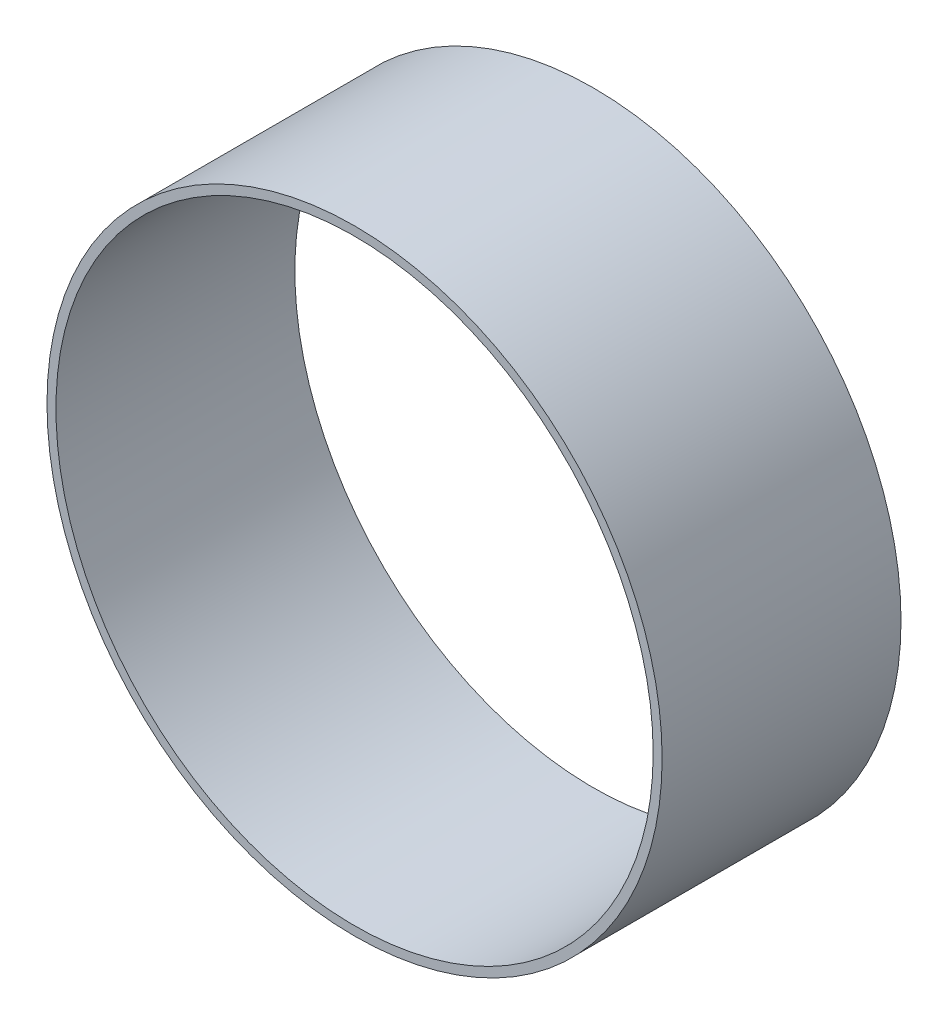
ISO-10303-21;
HEADER;
FILE_DESCRIPTION(('STEP AP214'),'2;1');
FILE_NAME('part.step','',(''),(''),'','','');
FILE_SCHEMA(('AUTOMOTIVE_DESIGN { 1 0 10303 214 1 1 1 1 }'));
ENDSEC;
DATA;
#1=APPLICATION_CONTEXT('core data for automotive mechanical design processes');
#2=APPLICATION_PROTOCOL_DEFINITION('international standard','automotive_design',2000,#1);
#3=PRODUCT_CONTEXT('',#1,'mechanical');
#4=PRODUCT('Part','Part','',(#3));
#5=PRODUCT_RELATED_PRODUCT_CATEGORY('part','',(#4));
#6=PRODUCT_DEFINITION_FORMATION('','',#4);
#7=PRODUCT_DEFINITION_CONTEXT('part definition',#1,'design');
#8=PRODUCT_DEFINITION('design','',#6,#7);
#9=PRODUCT_DEFINITION_SHAPE('','',#8);
#10=(LENGTH_UNIT() NAMED_UNIT(*) SI_UNIT(.MILLI.,.METRE.));
#11=(NAMED_UNIT(*) PLANE_ANGLE_UNIT() SI_UNIT($,.RADIAN.));
#12=(NAMED_UNIT(*) SI_UNIT($,.STERADIAN.) SOLID_ANGLE_UNIT());
#13=UNCERTAINTY_MEASURE_WITH_UNIT(LENGTH_MEASURE(1.E-05),#10,'distance_accuracy_value','');
#14=(GEOMETRIC_REPRESENTATION_CONTEXT(3) GLOBAL_UNCERTAINTY_ASSIGNED_CONTEXT((#13)) GLOBAL_UNIT_ASSIGNED_CONTEXT((#10,
#11,#12)) REPRESENTATION_CONTEXT('',''));
#15=CARTESIAN_POINT('',(0.,0.,0.));
#16=DIRECTION('',(0.,0.,1.));
#17=DIRECTION('',(1.,0.,0.));
#18=AXIS2_PLACEMENT_3D('',#15,#16,#17);
#19=CARTESIAN_POINT('',(0.,0.,25.4));
#20=DIRECTION('',(0.,0.,1.));
#21=DIRECTION('',(1.,0.,0.));
#22=AXIS2_PLACEMENT_3D('',#19,#20,#21);
#23=PLANE('',#22);
#24=CARTESIAN_POINT('',(0.,0.,25.4));
#25=DIRECTION('',(0.,0.,1.));
#26=DIRECTION('',(1.,0.,0.));
#27=AXIS2_PLACEMENT_3D('',#24,#25,#26);
#28=CIRCLE('',#27,65.405);
#29=CARTESIAN_POINT('',(65.405,0.,25.4));
#30=VERTEX_POINT('',#29);
#31=EDGE_CURVE('E10',#30,#30,#28,.T.);
#32=ORIENTED_EDGE('',*,*,#31,.T.);
#33=EDGE_LOOP('',(#32));
#34=FACE_BOUND('',#33,.T.);
#35=CARTESIAN_POINT('',(0.,0.,25.4));
#36=DIRECTION('',(0.,0.,1.));
#37=DIRECTION('',(1.,0.,0.));
#38=AXIS2_PLACEMENT_3D('',#35,#36,#37);
#39=CIRCLE('',#38,63.5);
#40=CARTESIAN_POINT('',(63.5,0.,25.4));
#41=VERTEX_POINT('',#40);
#42=EDGE_CURVE('E54',#41,#41,#39,.T.);
#43=ORIENTED_EDGE('',*,*,#42,.F.);
#44=EDGE_LOOP('',(#43));
#45=FACE_BOUND('',#44,.T.);
#46=ADVANCED_FACE('F43',(#34,#45),#23,.T.);
#47=CARTESIAN_POINT('',(0.,0.,-25.4));
#48=DIRECTION('',(0.,0.,1.));
#49=DIRECTION('',(1.,0.,0.));
#50=AXIS2_PLACEMENT_3D('',#47,#48,#49);
#51=PLANE('',#50);
#52=CARTESIAN_POINT('',(0.,0.,-25.4));
#53=DIRECTION('',(0.,0.,1.));
#54=DIRECTION('',(1.,0.,0.));
#55=AXIS2_PLACEMENT_3D('',#52,#53,#54);
#56=CIRCLE('',#55,65.405);
#57=CARTESIAN_POINT('',(65.405,0.,-25.4));
#58=VERTEX_POINT('',#57);
#59=EDGE_CURVE('E47',#58,#58,#56,.T.);
#60=ORIENTED_EDGE('',*,*,#59,.F.);
#61=EDGE_LOOP('',(#60));
#62=FACE_BOUND('',#61,.T.);
#63=CARTESIAN_POINT('',(0.,0.,-25.4));
#64=DIRECTION('',(0.,0.,1.));
#65=DIRECTION('',(1.,0.,0.));
#66=AXIS2_PLACEMENT_3D('',#63,#64,#65);
#67=CIRCLE('',#66,63.5);
#68=CARTESIAN_POINT('',(63.5,0.,-25.4));
#69=VERTEX_POINT('',#68);
#70=EDGE_CURVE('E56',#69,#69,#67,.T.);
#71=ORIENTED_EDGE('',*,*,#70,.T.);
#72=EDGE_LOOP('',(#71));
#73=FACE_BOUND('',#72,.T.);
#74=ADVANCED_FACE('F66',(#62,#73),#51,.F.);
#75=CARTESIAN_POINT('',(0.,0.,25.4));
#76=DIRECTION('',(0.,0.,-1.));
#77=DIRECTION('',(-1.,0.,0.));
#78=AXIS2_PLACEMENT_3D('',#75,#76,#77);
#79=CYLINDRICAL_SURFACE('',#78,65.405);
#80=ORIENTED_EDGE('',*,*,#31,.F.);
#81=EDGE_LOOP('',(#80));
#82=FACE_BOUND('',#81,.T.);
#83=ORIENTED_EDGE('',*,*,#59,.T.);
#84=EDGE_LOOP('',(#83));
#85=FACE_BOUND('',#84,.T.);
#86=ADVANCED_FACE('F45',(#82,#85),#79,.T.);
#87=CARTESIAN_POINT('',(0.,0.,25.4));
#88=DIRECTION('',(0.,0.,-1.));
#89=DIRECTION('',(-1.,0.,0.));
#90=AXIS2_PLACEMENT_3D('',#87,#88,#89);
#91=CYLINDRICAL_SURFACE('',#90,63.5);
#92=ORIENTED_EDGE('',*,*,#42,.T.);
#93=EDGE_LOOP('',(#92));
#94=FACE_BOUND('',#93,.T.);
#95=ORIENTED_EDGE('',*,*,#70,.F.);
#96=EDGE_LOOP('',(#95));
#97=FACE_BOUND('',#96,.T.);
#98=ADVANCED_FACE('F62',(#94,#97),#91,.F.);
#99=CLOSED_SHELL('',(#46,#74,#86,#98));
#100=MANIFOLD_SOLID_BREP('B2',#99);
#101=ADVANCED_BREP_SHAPE_REPRESENTATION('',(#18,#100),#14);
#102=SHAPE_DEFINITION_REPRESENTATION(#9,#101);
ENDSEC;
END-ISO-10303-21;
